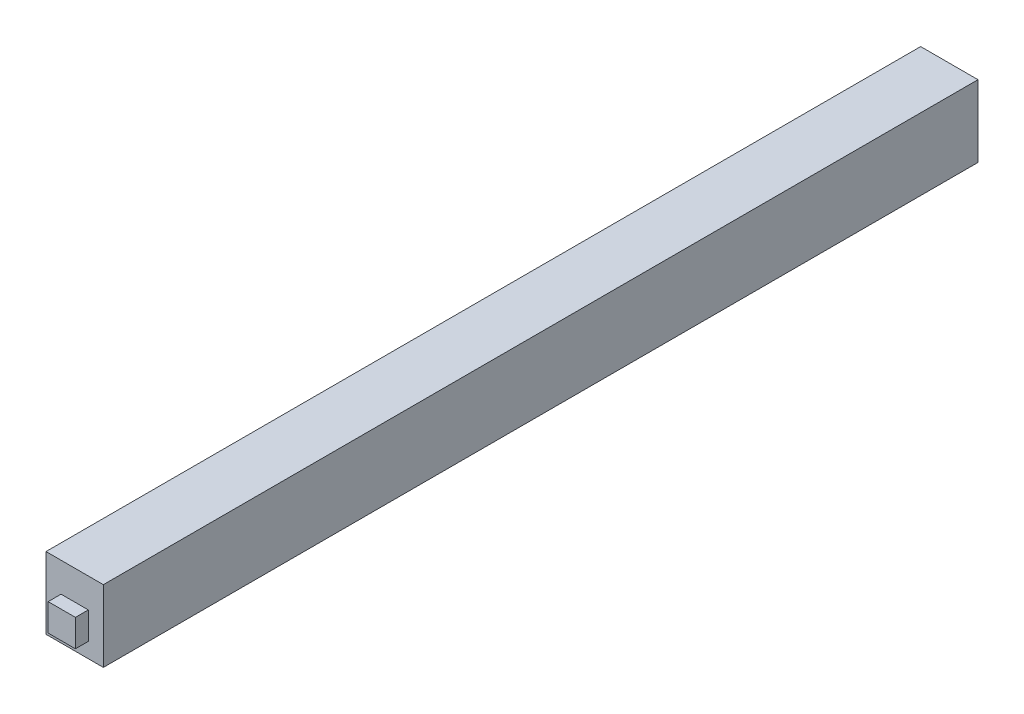
ISO-10303-21;
HEADER;
FILE_DESCRIPTION(('STEP AP214'),'2;1');
FILE_NAME('part.step','',(''),(''),'','','');
FILE_SCHEMA(('AUTOMOTIVE_DESIGN { 1 0 10303 214 1 1 1 1 }'));
ENDSEC;
DATA;
#1=APPLICATION_CONTEXT('core data for automotive mechanical design processes');
#2=APPLICATION_PROTOCOL_DEFINITION('international standard','automotive_design',2000,#1);
#3=PRODUCT_CONTEXT('',#1,'mechanical');
#4=PRODUCT('Part','Part','',(#3));
#5=PRODUCT_RELATED_PRODUCT_CATEGORY('part','',(#4));
#6=PRODUCT_DEFINITION_FORMATION('','',#4);
#7=PRODUCT_DEFINITION_CONTEXT('part definition',#1,'design');
#8=PRODUCT_DEFINITION('design','',#6,#7);
#9=PRODUCT_DEFINITION_SHAPE('','',#8);
#10=(LENGTH_UNIT() NAMED_UNIT(*) SI_UNIT(.MILLI.,.METRE.));
#11=(NAMED_UNIT(*) PLANE_ANGLE_UNIT() SI_UNIT($,.RADIAN.));
#12=(NAMED_UNIT(*) SI_UNIT($,.STERADIAN.) SOLID_ANGLE_UNIT());
#13=UNCERTAINTY_MEASURE_WITH_UNIT(LENGTH_MEASURE(1.E-05),#10,'distance_accuracy_value','');
#14=(GEOMETRIC_REPRESENTATION_CONTEXT(3) GLOBAL_UNCERTAINTY_ASSIGNED_CONTEXT((#13)) GLOBAL_UNIT_ASSIGNED_CONTEXT((#10,
#11,#12)) REPRESENTATION_CONTEXT('',''));
#15=CARTESIAN_POINT('',(0.,0.,0.));
#16=DIRECTION('',(0.,0.,1.));
#17=DIRECTION('',(1.,0.,0.));
#18=AXIS2_PLACEMENT_3D('',#15,#16,#17);
#19=CARTESIAN_POINT('',(0.,0.,122.));
#20=DIRECTION('',(0.,0.,-1.));
#21=DIRECTION('',(-1.,0.,0.));
#22=AXIS2_PLACEMENT_3D('',#19,#20,#21);
#23=PLANE('',#22);
#24=DIRECTION('',(0.,-1.,0.));
#25=VECTOR('',#24,1.);
#26=CARTESIAN_POINT('',(0.,0.,122.));
#27=LINE('',#26,#25);
#28=CARTESIAN_POINT('',(0.,10.,122.));
#29=VERTEX_POINT('',#28);
#30=CARTESIAN_POINT('',(0.,0.,122.));
#31=VERTEX_POINT('',#30);
#32=EDGE_CURVE('E182',#29,#31,#27,.T.);
#33=ORIENTED_EDGE('',*,*,#32,.T.);
#34=DIRECTION('',(1.,0.,0.));
#35=VECTOR('',#34,1.);
#36=CARTESIAN_POINT('',(0.,0.,122.));
#37=LINE('',#36,#35);
#38=CARTESIAN_POINT('',(8.,0.,122.));
#39=VERTEX_POINT('',#38);
#40=EDGE_CURVE('E185',#31,#39,#37,.T.);
#41=ORIENTED_EDGE('',*,*,#40,.T.);
#42=DIRECTION('',(0.,1.,0.));
#43=VECTOR('',#42,1.);
#44=CARTESIAN_POINT('',(8.,0.,122.));
#45=LINE('',#44,#43);
#46=CARTESIAN_POINT('',(8.,10.,122.));
#47=VERTEX_POINT('',#46);
#48=EDGE_CURVE('E188',#39,#47,#45,.T.);
#49=ORIENTED_EDGE('',*,*,#48,.T.);
#50=DIRECTION('',(-1.,0.,0.));
#51=VECTOR('',#50,1.);
#52=CARTESIAN_POINT('',(0.,10.,122.));
#53=LINE('',#52,#51);
#54=EDGE_CURVE('E190',#47,#29,#53,.T.);
#55=ORIENTED_EDGE('',*,*,#54,.T.);
#56=EDGE_LOOP('',(#33,#41,#49,#55));
#57=FACE_BOUND('',#56,.T.);
#58=DIRECTION('',(1.,0.,0.));
#59=VECTOR('',#58,1.);
#60=CARTESIAN_POINT('',(0.,2.1,122.));
#61=LINE('',#60,#59);
#62=CARTESIAN_POINT('',(2.1,2.1,122.));
#63=VERTEX_POINT('',#62);
#64=CARTESIAN_POINT('',(5.9,2.1,122.));
#65=VERTEX_POINT('',#64);
#66=EDGE_CURVE('E48',#63,#65,#61,.T.);
#67=ORIENTED_EDGE('',*,*,#66,.F.);
#68=DIRECTION('',(0.,1.,0.));
#69=VECTOR('',#68,1.);
#70=CARTESIAN_POINT('',(2.1,0.,122.));
#71=LINE('',#70,#69);
#72=CARTESIAN_POINT('',(2.1,5.9,122.));
#73=VERTEX_POINT('',#72);
#74=EDGE_CURVE('E53',#63,#73,#71,.T.);
#75=ORIENTED_EDGE('',*,*,#74,.T.);
#76=DIRECTION('',(1.,0.,0.));
#77=VECTOR('',#76,1.);
#78=CARTESIAN_POINT('',(0.,5.9,122.));
#79=LINE('',#78,#77);
#80=CARTESIAN_POINT('',(5.9,5.9,122.));
#81=VERTEX_POINT('',#80);
#82=EDGE_CURVE('E368',#73,#81,#79,.T.);
#83=ORIENTED_EDGE('',*,*,#82,.T.);
#84=DIRECTION('',(0.,1.,0.));
#85=VECTOR('',#84,1.);
#86=CARTESIAN_POINT('',(5.9,0.,122.));
#87=LINE('',#86,#85);
#88=EDGE_CURVE('E370',#65,#81,#87,.T.);
#89=ORIENTED_EDGE('',*,*,#88,.F.);
#90=EDGE_LOOP('',(#67,#75,#83,#89));
#91=FACE_BOUND('',#90,.T.);
#92=ADVANCED_FACE('F33',(#57,#91),#23,.F.);
#93=CARTESIAN_POINT('',(0.,0.,122.));
#94=DIRECTION('',(1.,0.,0.));
#95=DIRECTION('',(0.,0.,-1.));
#96=AXIS2_PLACEMENT_3D('',#93,#94,#95);
#97=PLANE('',#96);
#98=DIRECTION('',(0.,-1.,0.));
#99=VECTOR('',#98,1.);
#100=CARTESIAN_POINT('',(0.,0.,0.));
#101=LINE('',#100,#99);
#102=CARTESIAN_POINT('',(0.,10.,0.));
#103=VERTEX_POINT('',#102);
#104=CARTESIAN_POINT('',(0.,0.,0.));
#105=VERTEX_POINT('',#104);
#106=EDGE_CURVE('E181',#103,#105,#101,.T.);
#107=ORIENTED_EDGE('',*,*,#106,.T.);
#108=DIRECTION('',(0.,0.,-1.));
#109=VECTOR('',#108,1.);
#110=CARTESIAN_POINT('',(0.,0.,122.));
#111=LINE('',#110,#109);
#112=EDGE_CURVE('E11',#31,#105,#111,.T.);
#113=ORIENTED_EDGE('',*,*,#112,.F.);
#114=ORIENTED_EDGE('',*,*,#32,.F.);
#115=DIRECTION('',(0.,0.,-1.));
#116=VECTOR('',#115,1.);
#117=CARTESIAN_POINT('',(0.,10.,122.));
#118=LINE('',#117,#116);
#119=EDGE_CURVE('E192',#29,#103,#118,.T.);
#120=ORIENTED_EDGE('',*,*,#119,.T.);
#121=EDGE_LOOP('',(#107,#113,#114,#120));
#122=FACE_BOUND('',#121,.T.);
#123=ADVANCED_FACE('F35',(#122),#97,.F.);
#124=CARTESIAN_POINT('',(0.,0.,122.));
#125=DIRECTION('',(0.,1.,0.));
#126=DIRECTION('',(0.,0.,1.));
#127=AXIS2_PLACEMENT_3D('',#124,#125,#126);
#128=PLANE('',#127);
#129=DIRECTION('',(1.,0.,0.));
#130=VECTOR('',#129,1.);
#131=CARTESIAN_POINT('',(0.,0.,0.));
#132=LINE('',#131,#130);
#133=CARTESIAN_POINT('',(8.,0.,0.));
#134=VERTEX_POINT('',#133);
#135=EDGE_CURVE('E195',#105,#134,#132,.T.);
#136=ORIENTED_EDGE('',*,*,#135,.T.);
#137=DIRECTION('',(0.,0.,-1.));
#138=VECTOR('',#137,1.);
#139=CARTESIAN_POINT('',(8.,0.,122.));
#140=LINE('',#139,#138);
#141=EDGE_CURVE('E41',#39,#134,#140,.T.);
#142=ORIENTED_EDGE('',*,*,#141,.F.);
#143=ORIENTED_EDGE('',*,*,#40,.F.);
#144=ORIENTED_EDGE('',*,*,#112,.T.);
#145=EDGE_LOOP('',(#136,#142,#143,#144));
#146=FACE_BOUND('',#145,.T.);
#147=ADVANCED_FACE('F224',(#146),#128,.F.);
#148=CARTESIAN_POINT('',(8.,0.,122.));
#149=DIRECTION('',(-1.,0.,0.));
#150=DIRECTION('',(0.,0.,1.));
#151=AXIS2_PLACEMENT_3D('',#148,#149,#150);
#152=PLANE('',#151);
#153=DIRECTION('',(0.,1.,0.));
#154=VECTOR('',#153,1.);
#155=CARTESIAN_POINT('',(8.,0.,0.));
#156=LINE('',#155,#154);
#157=CARTESIAN_POINT('',(8.,10.,0.));
#158=VERTEX_POINT('',#157);
#159=EDGE_CURVE('E197',#134,#158,#156,.T.);
#160=ORIENTED_EDGE('',*,*,#159,.T.);
#161=DIRECTION('',(0.,0.,-1.));
#162=VECTOR('',#161,1.);
#163=CARTESIAN_POINT('',(8.,10.,122.));
#164=LINE('',#163,#162);
#165=EDGE_CURVE('E202',#47,#158,#164,.T.);
#166=ORIENTED_EDGE('',*,*,#165,.F.);
#167=ORIENTED_EDGE('',*,*,#48,.F.);
#168=ORIENTED_EDGE('',*,*,#141,.T.);
#169=EDGE_LOOP('',(#160,#166,#167,#168));
#170=FACE_BOUND('',#169,.T.);
#171=ADVANCED_FACE('F209',(#170),#152,.F.);
#172=CARTESIAN_POINT('',(0.,10.,122.));
#173=DIRECTION('',(0.,-1.,0.));
#174=DIRECTION('',(0.,0.,-1.));
#175=AXIS2_PLACEMENT_3D('',#172,#173,#174);
#176=PLANE('',#175);
#177=DIRECTION('',(-1.,0.,0.));
#178=VECTOR('',#177,1.);
#179=CARTESIAN_POINT('',(0.,10.,0.));
#180=LINE('',#179,#178);
#181=EDGE_CURVE('E186',#158,#103,#180,.T.);
#182=ORIENTED_EDGE('',*,*,#181,.T.);
#183=ORIENTED_EDGE('',*,*,#119,.F.);
#184=ORIENTED_EDGE('',*,*,#54,.F.);
#185=ORIENTED_EDGE('',*,*,#165,.T.);
#186=EDGE_LOOP('',(#182,#183,#184,#185));
#187=FACE_BOUND('',#186,.T.);
#188=ADVANCED_FACE('F218',(#187),#176,.F.);
#189=CARTESIAN_POINT('',(0.,0.,0.));
#190=DIRECTION('',(0.,0.,-1.));
#191=DIRECTION('',(-1.,0.,0.));
#192=AXIS2_PLACEMENT_3D('',#189,#190,#191);
#193=PLANE('',#192);
#194=DIRECTION('',(0.,1.,0.));
#195=VECTOR('',#194,1.);
#196=CARTESIAN_POINT('',(2.1,2.1,0.));
#197=LINE('',#196,#195);
#198=CARTESIAN_POINT('',(2.1,2.1,0.));
#199=VERTEX_POINT('',#198);
#200=CARTESIAN_POINT('',(2.1,5.9,0.));
#201=VERTEX_POINT('',#200);
#202=EDGE_CURVE('E143',#199,#201,#197,.T.);
#203=ORIENTED_EDGE('',*,*,#202,.F.);
#204=DIRECTION('',(-1.,0.,0.));
#205=VECTOR('',#204,1.);
#206=CARTESIAN_POINT('',(5.9,2.1,0.));
#207=LINE('',#206,#205);
#208=CARTESIAN_POINT('',(5.9,2.1,0.));
#209=VERTEX_POINT('',#208);
#210=EDGE_CURVE('E156',#209,#199,#207,.T.);
#211=ORIENTED_EDGE('',*,*,#210,.F.);
#212=DIRECTION('',(0.,-1.,0.));
#213=VECTOR('',#212,1.);
#214=CARTESIAN_POINT('',(5.9,2.1,0.));
#215=LINE('',#214,#213);
#216=CARTESIAN_POINT('',(5.9,5.9,0.));
#217=VERTEX_POINT('',#216);
#218=EDGE_CURVE('E165',#217,#209,#215,.T.);
#219=ORIENTED_EDGE('',*,*,#218,.F.);
#220=DIRECTION('',(1.,0.,0.));
#221=VECTOR('',#220,1.);
#222=CARTESIAN_POINT('',(5.9,5.9,0.));
#223=LINE('',#222,#221);
#224=EDGE_CURVE('E146',#201,#217,#223,.T.);
#225=ORIENTED_EDGE('',*,*,#224,.F.);
#226=EDGE_LOOP('',(#203,#211,#219,#225));
#227=FACE_BOUND('',#226,.T.);
#228=ORIENTED_EDGE('',*,*,#106,.F.);
#229=ORIENTED_EDGE('',*,*,#181,.F.);
#230=ORIENTED_EDGE('',*,*,#159,.F.);
#231=ORIENTED_EDGE('',*,*,#135,.F.);
#232=EDGE_LOOP('',(#228,#229,#230,#231));
#233=FACE_BOUND('',#232,.T.);
#234=ADVANCED_FACE('F215',(#227,#233),#193,.T.);
#235=CARTESIAN_POINT('',(2.1,2.1,-1.8));
#236=DIRECTION('',(1.,0.,0.));
#237=DIRECTION('',(0.,0.,-1.));
#238=AXIS2_PLACEMENT_3D('',#235,#236,#237);
#239=PLANE('',#238);
#240=ORIENTED_EDGE('',*,*,#202,.T.);
#241=DIRECTION('',(0.,0.,1.));
#242=VECTOR('',#241,1.);
#243=CARTESIAN_POINT('',(2.1,5.9,-1.8));
#244=LINE('',#243,#242);
#245=CARTESIAN_POINT('',(2.1,5.9,-1.8));
#246=VERTEX_POINT('',#245);
#247=EDGE_CURVE('E178',#246,#201,#244,.T.);
#248=ORIENTED_EDGE('',*,*,#247,.F.);
#249=DIRECTION('',(0.,1.,0.));
#250=VECTOR('',#249,1.);
#251=CARTESIAN_POINT('',(2.1,2.1,-1.8));
#252=LINE('',#251,#250);
#253=CARTESIAN_POINT('',(2.1,2.1,-1.8));
#254=VERTEX_POINT('',#253);
#255=EDGE_CURVE('E152',#254,#246,#252,.T.);
#256=ORIENTED_EDGE('',*,*,#255,.F.);
#257=DIRECTION('',(0.,0.,1.));
#258=VECTOR('',#257,1.);
#259=CARTESIAN_POINT('',(2.1,2.1,-1.8));
#260=LINE('',#259,#258);
#261=EDGE_CURVE('E161',#254,#199,#260,.T.);
#262=ORIENTED_EDGE('',*,*,#261,.T.);
#263=EDGE_LOOP('',(#240,#248,#256,#262));
#264=FACE_BOUND('',#263,.T.);
#265=ADVANCED_FACE('F237',(#264),#239,.F.);
#266=CARTESIAN_POINT('',(5.9,5.9,-1.8));
#267=DIRECTION('',(0.,-1.,0.));
#268=DIRECTION('',(0.,0.,-1.));
#269=AXIS2_PLACEMENT_3D('',#266,#267,#268);
#270=PLANE('',#269);
#271=ORIENTED_EDGE('',*,*,#224,.T.);
#272=DIRECTION('',(0.,0.,1.));
#273=VECTOR('',#272,1.);
#274=CARTESIAN_POINT('',(5.9,5.9,-1.8));
#275=LINE('',#274,#273);
#276=CARTESIAN_POINT('',(5.9,5.9,-1.8));
#277=VERTEX_POINT('',#276);
#278=EDGE_CURVE('E175',#277,#217,#275,.T.);
#279=ORIENTED_EDGE('',*,*,#278,.F.);
#280=DIRECTION('',(1.,0.,0.));
#281=VECTOR('',#280,1.);
#282=CARTESIAN_POINT('',(5.9,5.9,-1.8));
#283=LINE('',#282,#281);
#284=EDGE_CURVE('E155',#246,#277,#283,.T.);
#285=ORIENTED_EDGE('',*,*,#284,.F.);
#286=ORIENTED_EDGE('',*,*,#247,.T.);
#287=EDGE_LOOP('',(#271,#279,#285,#286));
#288=FACE_BOUND('',#287,.T.);
#289=ADVANCED_FACE('F257',(#288),#270,.F.);
#290=CARTESIAN_POINT('',(5.9,2.1,-1.8));
#291=DIRECTION('',(-1.,0.,0.));
#292=DIRECTION('',(0.,0.,1.));
#293=AXIS2_PLACEMENT_3D('',#290,#291,#292);
#294=PLANE('',#293);
#295=ORIENTED_EDGE('',*,*,#218,.T.);
#296=DIRECTION('',(0.,0.,1.));
#297=VECTOR('',#296,1.);
#298=CARTESIAN_POINT('',(5.9,2.1,-1.8));
#299=LINE('',#298,#297);
#300=CARTESIAN_POINT('',(5.9,2.1,-1.8));
#301=VERTEX_POINT('',#300);
#302=EDGE_CURVE('E172',#301,#209,#299,.T.);
#303=ORIENTED_EDGE('',*,*,#302,.F.);
#304=DIRECTION('',(0.,-1.,0.));
#305=VECTOR('',#304,1.);
#306=CARTESIAN_POINT('',(5.9,2.1,-1.8));
#307=LINE('',#306,#305);
#308=EDGE_CURVE('E158',#277,#301,#307,.T.);
#309=ORIENTED_EDGE('',*,*,#308,.F.);
#310=ORIENTED_EDGE('',*,*,#278,.T.);
#311=EDGE_LOOP('',(#295,#303,#309,#310));
#312=FACE_BOUND('',#311,.T.);
#313=ADVANCED_FACE('F264',(#312),#294,.F.);
#314=CARTESIAN_POINT('',(5.9,2.1,-1.8));
#315=DIRECTION('',(0.,1.,0.));
#316=DIRECTION('',(0.,0.,1.));
#317=AXIS2_PLACEMENT_3D('',#314,#315,#316);
#318=PLANE('',#317);
#319=ORIENTED_EDGE('',*,*,#210,.T.);
#320=ORIENTED_EDGE('',*,*,#261,.F.);
#321=DIRECTION('',(-1.,0.,0.));
#322=VECTOR('',#321,1.);
#323=CARTESIAN_POINT('',(5.9,2.1,-1.8));
#324=LINE('',#323,#322);
#325=EDGE_CURVE('E160',#301,#254,#324,.T.);
#326=ORIENTED_EDGE('',*,*,#325,.F.);
#327=ORIENTED_EDGE('',*,*,#302,.T.);
#328=EDGE_LOOP('',(#319,#320,#326,#327));
#329=FACE_BOUND('',#328,.T.);
#330=ADVANCED_FACE('F271',(#329),#318,.F.);
#331=CARTESIAN_POINT('',(0.,0.,-1.8));
#332=DIRECTION('',(0.,0.,1.));
#333=DIRECTION('',(1.,0.,0.));
#334=AXIS2_PLACEMENT_3D('',#331,#332,#333);
#335=PLANE('',#334);
#336=ORIENTED_EDGE('',*,*,#255,.T.);
#337=ORIENTED_EDGE('',*,*,#284,.T.);
#338=ORIENTED_EDGE('',*,*,#308,.T.);
#339=ORIENTED_EDGE('',*,*,#325,.T.);
#340=EDGE_LOOP('',(#336,#337,#338,#339));
#341=FACE_BOUND('',#340,.T.);
#342=ADVANCED_FACE('F279',(#341),#335,.F.);
#343=CARTESIAN_POINT('',(0.,2.1,123.8));
#344=DIRECTION('',(0.,1.,0.));
#345=DIRECTION('',(0.,0.,1.));
#346=AXIS2_PLACEMENT_3D('',#343,#344,#345);
#347=PLANE('',#346);
#348=ORIENTED_EDGE('',*,*,#66,.T.);
#349=DIRECTION('',(0.,0.,-1.));
#350=VECTOR('',#349,1.);
#351=CARTESIAN_POINT('',(5.9,2.1,123.8));
#352=LINE('',#351,#350);
#353=CARTESIAN_POINT('',(5.9,2.1,123.8));
#354=VERTEX_POINT('',#353);
#355=EDGE_CURVE('E126',#354,#65,#352,.T.);
#356=ORIENTED_EDGE('',*,*,#355,.F.);
#357=DIRECTION('',(1.,0.,0.));
#358=VECTOR('',#357,1.);
#359=CARTESIAN_POINT('',(0.,2.1,123.8));
#360=LINE('',#359,#358);
#361=CARTESIAN_POINT('',(2.1,2.1,123.8));
#362=VERTEX_POINT('',#361);
#363=EDGE_CURVE('E133',#362,#354,#360,.T.);
#364=ORIENTED_EDGE('',*,*,#363,.F.);
#365=DIRECTION('',(0.,0.,-1.));
#366=VECTOR('',#365,1.);
#367=CARTESIAN_POINT('',(2.1,2.1,123.8));
#368=LINE('',#367,#366);
#369=EDGE_CURVE('E366',#362,#63,#368,.T.);
#370=ORIENTED_EDGE('',*,*,#369,.T.);
#371=EDGE_LOOP('',(#348,#356,#364,#370));
#372=FACE_BOUND('',#371,.T.);
#373=ADVANCED_FACE('F142',(#372),#347,.F.);
#374=CARTESIAN_POINT('',(5.9,0.,123.8));
#375=DIRECTION('',(-1.,0.,0.));
#376=DIRECTION('',(0.,0.,1.));
#377=AXIS2_PLACEMENT_3D('',#374,#375,#376);
#378=PLANE('',#377);
#379=ORIENTED_EDGE('',*,*,#88,.T.);
#380=DIRECTION('',(0.,0.,-1.));
#381=VECTOR('',#380,1.);
#382=CARTESIAN_POINT('',(5.9,5.9,123.8));
#383=LINE('',#382,#381);
#384=CARTESIAN_POINT('',(5.9,5.9,123.8));
#385=VERTEX_POINT('',#384);
#386=EDGE_CURVE('E128',#385,#81,#383,.T.);
#387=ORIENTED_EDGE('',*,*,#386,.F.);
#388=DIRECTION('',(0.,1.,0.));
#389=VECTOR('',#388,1.);
#390=CARTESIAN_POINT('',(5.9,0.,123.8));
#391=LINE('',#390,#389);
#392=EDGE_CURVE('E121',#354,#385,#391,.T.);
#393=ORIENTED_EDGE('',*,*,#392,.F.);
#394=ORIENTED_EDGE('',*,*,#355,.T.);
#395=EDGE_LOOP('',(#379,#387,#393,#394));
#396=FACE_BOUND('',#395,.T.);
#397=ADVANCED_FACE('F124',(#396),#378,.F.);
#398=CARTESIAN_POINT('',(0.,5.9,123.8));
#399=DIRECTION('',(0.,1.,0.));
#400=DIRECTION('',(0.,0.,1.));
#401=AXIS2_PLACEMENT_3D('',#398,#399,#400);
#402=PLANE('',#401);
#403=ORIENTED_EDGE('',*,*,#82,.F.);
#404=DIRECTION('',(0.,0.,-1.));
#405=VECTOR('',#404,1.);
#406=CARTESIAN_POINT('',(2.1,5.9,123.8));
#407=LINE('',#406,#405);
#408=CARTESIAN_POINT('',(2.1,5.9,123.8));
#409=VERTEX_POINT('',#408);
#410=EDGE_CURVE('E148',#409,#73,#407,.T.);
#411=ORIENTED_EDGE('',*,*,#410,.F.);
#412=DIRECTION('',(1.,0.,0.));
#413=VECTOR('',#412,1.);
#414=CARTESIAN_POINT('',(0.,5.9,123.8));
#415=LINE('',#414,#413);
#416=EDGE_CURVE('E132',#409,#385,#415,.T.);
#417=ORIENTED_EDGE('',*,*,#416,.T.);
#418=ORIENTED_EDGE('',*,*,#386,.T.);
#419=EDGE_LOOP('',(#403,#411,#417,#418));
#420=FACE_BOUND('',#419,.T.);
#421=ADVANCED_FACE('F300',(#420),#402,.T.);
#422=CARTESIAN_POINT('',(2.1,0.,123.8));
#423=DIRECTION('',(-1.,0.,0.));
#424=DIRECTION('',(0.,0.,1.));
#425=AXIS2_PLACEMENT_3D('',#422,#423,#424);
#426=PLANE('',#425);
#427=ORIENTED_EDGE('',*,*,#74,.F.);
#428=ORIENTED_EDGE('',*,*,#369,.F.);
#429=DIRECTION('',(0.,1.,0.));
#430=VECTOR('',#429,1.);
#431=CARTESIAN_POINT('',(2.1,0.,123.8));
#432=LINE('',#431,#430);
#433=EDGE_CURVE('E139',#362,#409,#432,.T.);
#434=ORIENTED_EDGE('',*,*,#433,.T.);
#435=ORIENTED_EDGE('',*,*,#410,.T.);
#436=EDGE_LOOP('',(#427,#428,#434,#435));
#437=FACE_BOUND('',#436,.T.);
#438=ADVANCED_FACE('F307',(#437),#426,.T.);
#439=CARTESIAN_POINT('',(0.,0.,123.8));
#440=DIRECTION('',(0.,0.,1.));
#441=DIRECTION('',(1.,0.,0.));
#442=AXIS2_PLACEMENT_3D('',#439,#440,#441);
#443=PLANE('',#442);
#444=ORIENTED_EDGE('',*,*,#363,.T.);
#445=ORIENTED_EDGE('',*,*,#392,.T.);
#446=ORIENTED_EDGE('',*,*,#416,.F.);
#447=ORIENTED_EDGE('',*,*,#433,.F.);
#448=EDGE_LOOP('',(#444,#445,#446,#447));
#449=FACE_BOUND('',#448,.T.);
#450=ADVANCED_FACE('F137',(#449),#443,.T.);
#451=CLOSED_SHELL('',(#92,#123,#147,#171,#188,#234,#265,#289,#313,#330,#342,#373,#397,#421,#438,#450));
#452=MANIFOLD_SOLID_BREP('B2',#451);
#453=ADVANCED_BREP_SHAPE_REPRESENTATION('',(#18,#452),#14);
#454=SHAPE_DEFINITION_REPRESENTATION(#9,#453);
ENDSEC;
END-ISO-10303-21;
